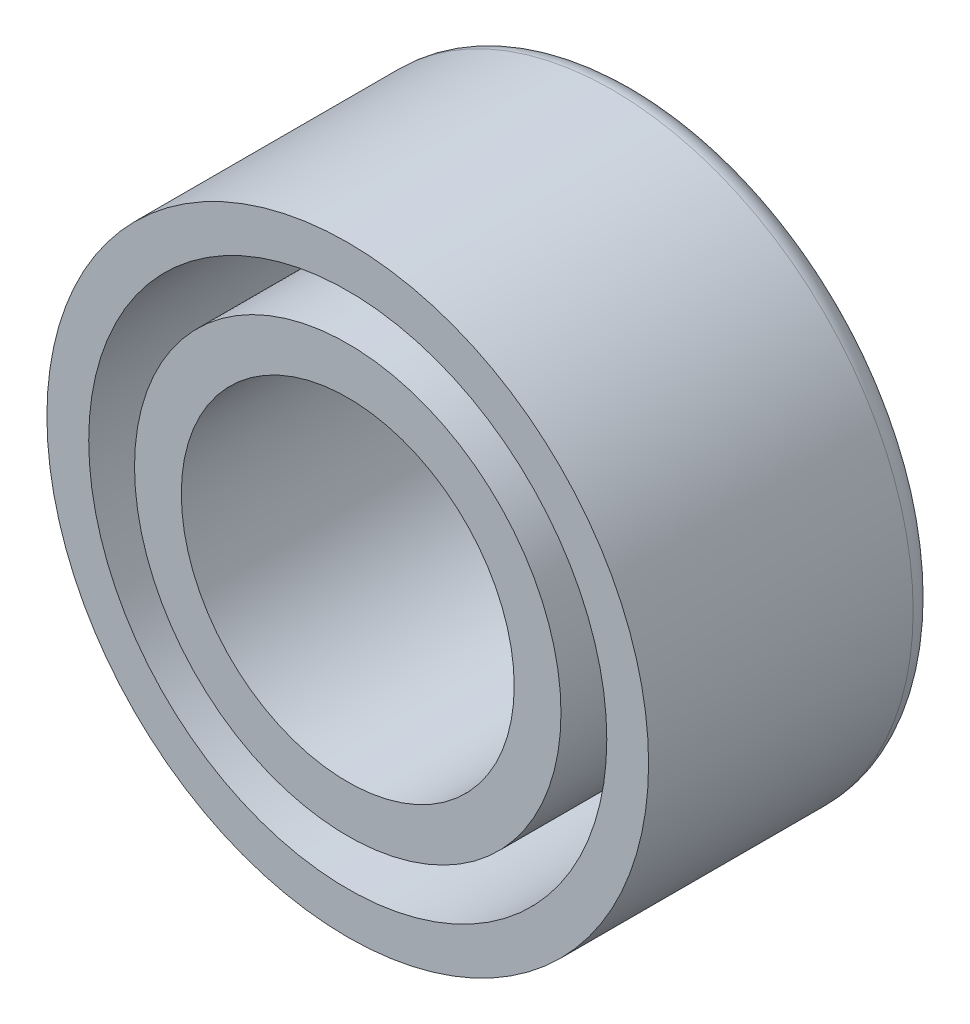
ISO-10303-21;
HEADER;
FILE_DESCRIPTION(('STEP AP214'),'2;1');
FILE_NAME('part.step','',(''),(''),'','','');
FILE_SCHEMA(('AUTOMOTIVE_DESIGN { 1 0 10303 214 1 1 1 1 }'));
ENDSEC;
DATA;
#1=APPLICATION_CONTEXT('core data for automotive mechanical design processes');
#2=APPLICATION_PROTOCOL_DEFINITION('international standard','automotive_design',2000,#1);
#3=PRODUCT_CONTEXT('',#1,'mechanical');
#4=PRODUCT('Part','Part','',(#3));
#5=PRODUCT_RELATED_PRODUCT_CATEGORY('part','',(#4));
#6=PRODUCT_DEFINITION_FORMATION('','',#4);
#7=PRODUCT_DEFINITION_CONTEXT('part definition',#1,'design');
#8=PRODUCT_DEFINITION('design','',#6,#7);
#9=PRODUCT_DEFINITION_SHAPE('','',#8);
#10=(LENGTH_UNIT() NAMED_UNIT(*) SI_UNIT(.MILLI.,.METRE.));
#11=(NAMED_UNIT(*) PLANE_ANGLE_UNIT() SI_UNIT($,.RADIAN.));
#12=(NAMED_UNIT(*) SI_UNIT($,.STERADIAN.) SOLID_ANGLE_UNIT());
#13=UNCERTAINTY_MEASURE_WITH_UNIT(LENGTH_MEASURE(1.E-05),#10,'distance_accuracy_value','');
#14=(GEOMETRIC_REPRESENTATION_CONTEXT(3) GLOBAL_UNCERTAINTY_ASSIGNED_CONTEXT((#13)) GLOBAL_UNIT_ASSIGNED_CONTEXT((#10,
#11,#12)) REPRESENTATION_CONTEXT('',''));
#15=CARTESIAN_POINT('',(0.,0.,0.));
#16=DIRECTION('',(0.,0.,1.));
#17=DIRECTION('',(1.,0.,0.));
#18=AXIS2_PLACEMENT_3D('',#15,#16,#17);
#19=CARTESIAN_POINT('',(0.,0.,12.));
#20=DIRECTION('',(0.,0.,1.));
#21=DIRECTION('',(1.,0.,0.));
#22=AXIS2_PLACEMENT_3D('',#19,#20,#21);
#23=PLANE('',#22);
#24=CARTESIAN_POINT('',(0.,0.,12.));
#25=DIRECTION('',(0.,0.,1.));
#26=DIRECTION('',(1.,0.,0.));
#27=AXIS2_PLACEMENT_3D('',#24,#25,#26);
#28=CIRCLE('',#27,6.9215);
#29=CARTESIAN_POINT('',(6.9215,0.,12.));
#30=VERTEX_POINT('',#29);
#31=EDGE_CURVE('E54',#30,#30,#28,.T.);
#32=ORIENTED_EDGE('',*,*,#31,.F.);
#33=EDGE_LOOP('',(#32));
#34=FACE_BOUND('',#33,.T.);
#35=CARTESIAN_POINT('',(0.,0.,12.));
#36=DIRECTION('',(0.,0.,1.));
#37=DIRECTION('',(1.,0.,0.));
#38=AXIS2_PLACEMENT_3D('',#35,#36,#37);
#39=CIRCLE('',#38,8.8665);
#40=CARTESIAN_POINT('',(8.8665,0.,12.));
#41=VERTEX_POINT('',#40);
#42=EDGE_CURVE('E64',#41,#41,#39,.T.);
#43=ORIENTED_EDGE('',*,*,#42,.T.);
#44=EDGE_LOOP('',(#43));
#45=FACE_BOUND('',#44,.T.);
#46=ADVANCED_FACE('F31',(#34,#45),#23,.T.);
#47=CARTESIAN_POINT('',(0.,0.,12.));
#48=DIRECTION('',(0.,0.,1.));
#49=DIRECTION('',(1.,0.,0.));
#50=AXIS2_PLACEMENT_3D('',#47,#48,#49);
#51=CIRCLE('',#50,10.7715);
#52=CARTESIAN_POINT('',(10.7715,0.,12.));
#53=VERTEX_POINT('',#52);
#54=EDGE_CURVE('E58',#53,#53,#51,.T.);
#55=ORIENTED_EDGE('',*,*,#54,.F.);
#56=EDGE_LOOP('',(#55));
#57=FACE_BOUND('',#56,.T.);
#58=CARTESIAN_POINT('',(0.,0.,12.));
#59=DIRECTION('',(0.,0.,1.));
#60=DIRECTION('',(1.,0.,0.));
#61=AXIS2_PLACEMENT_3D('',#58,#59,#60);
#62=CIRCLE('',#61,12.5095);
#63=CARTESIAN_POINT('',(12.5095,0.,12.));
#64=VERTEX_POINT('',#63);
#65=EDGE_CURVE('E51',#64,#64,#62,.T.);
#66=ORIENTED_EDGE('',*,*,#65,.T.);
#67=EDGE_LOOP('',(#66));
#68=FACE_BOUND('',#67,.T.);
#69=ADVANCED_FACE('F85',(#57,#68),#23,.T.);
#70=CARTESIAN_POINT('',(0.,0.,0.));
#71=DIRECTION('',(0.,0.,1.));
#72=DIRECTION('',(1.,0.,0.));
#73=AXIS2_PLACEMENT_3D('',#70,#71,#72);
#74=PLANE('',#73);
#75=CARTESIAN_POINT('',(0.,0.,0.));
#76=DIRECTION('',(0.,0.,1.));
#77=DIRECTION('',(1.,0.,0.));
#78=AXIS2_PLACEMENT_3D('',#75,#76,#77);
#79=CIRCLE('',#78,7.9215);
#80=CARTESIAN_POINT('',(7.9215,0.,0.));
#81=VERTEX_POINT('',#80);
#82=EDGE_CURVE('E42',#81,#81,#79,.T.);
#83=ORIENTED_EDGE('',*,*,#82,.T.);
#84=EDGE_LOOP('',(#83));
#85=FACE_BOUND('',#84,.T.);
#86=CARTESIAN_POINT('',(0.,0.,0.));
#87=DIRECTION('',(0.,0.,1.));
#88=DIRECTION('',(1.,0.,0.));
#89=AXIS2_PLACEMENT_3D('',#86,#87,#88);
#90=CIRCLE('',#89,11.5095);
#91=CARTESIAN_POINT('',(11.5095,0.,0.));
#92=VERTEX_POINT('',#91);
#93=EDGE_CURVE('E46',#92,#92,#90,.F.);
#94=ORIENTED_EDGE('',*,*,#93,.T.);
#95=EDGE_LOOP('',(#94));
#96=FACE_BOUND('',#95,.T.);
#97=ADVANCED_FACE('F88',(#85,#96),#74,.F.);
#98=CARTESIAN_POINT('',(0.,0.,12.));
#99=DIRECTION('',(0.,0.,-1.));
#100=DIRECTION('',(-1.,0.,0.));
#101=AXIS2_PLACEMENT_3D('',#98,#99,#100);
#102=CYLINDRICAL_SURFACE('',#101,12.5095);
#103=CARTESIAN_POINT('',(0.,0.,1.));
#104=DIRECTION('',(0.,0.,1.));
#105=DIRECTION('',(1.,0.,0.));
#106=AXIS2_PLACEMENT_3D('',#103,#104,#105);
#107=CIRCLE('',#106,12.5095);
#108=CARTESIAN_POINT('',(12.5095,0.,1.));
#109=VERTEX_POINT('',#108);
#110=EDGE_CURVE('E10',#109,#109,#107,.T.);
#111=ORIENTED_EDGE('',*,*,#110,.T.);
#112=EDGE_LOOP('',(#111));
#113=FACE_BOUND('',#112,.T.);
#114=ORIENTED_EDGE('',*,*,#65,.F.);
#115=EDGE_LOOP('',(#114));
#116=FACE_BOUND('',#115,.T.);
#117=ADVANCED_FACE('F92',(#113,#116),#102,.T.);
#118=CARTESIAN_POINT('',(0.,0.,12.));
#119=DIRECTION('',(0.,0.,-1.));
#120=DIRECTION('',(-1.,0.,0.));
#121=AXIS2_PLACEMENT_3D('',#118,#119,#120);
#122=CYLINDRICAL_SURFACE('',#121,6.9215);
#123=CARTESIAN_POINT('',(0.,0.,1.));
#124=DIRECTION('',(0.,0.,1.));
#125=DIRECTION('',(1.,0.,0.));
#126=AXIS2_PLACEMENT_3D('',#123,#124,#125);
#127=CIRCLE('',#126,6.9215);
#128=CARTESIAN_POINT('',(6.9215,0.,1.));
#129=VERTEX_POINT('',#128);
#130=EDGE_CURVE('E38',#129,#129,#127,.F.);
#131=ORIENTED_EDGE('',*,*,#130,.T.);
#132=EDGE_LOOP('',(#131));
#133=FACE_BOUND('',#132,.T.);
#134=ORIENTED_EDGE('',*,*,#31,.T.);
#135=EDGE_LOOP('',(#134));
#136=FACE_BOUND('',#135,.T.);
#137=ADVANCED_FACE('F94',(#133,#136),#122,.F.);
#138=CARTESIAN_POINT('',(0.,0.,1.));
#139=DIRECTION('',(0.,0.,1.));
#140=DIRECTION('',(1.,0.,0.));
#141=AXIS2_PLACEMENT_3D('',#138,#139,#140);
#142=TOROIDAL_SURFACE('',#141,7.9215,1.);
#143=ORIENTED_EDGE('',*,*,#130,.F.);
#144=EDGE_LOOP('',(#143));
#145=FACE_BOUND('',#144,.T.);
#146=ORIENTED_EDGE('',*,*,#82,.F.);
#147=EDGE_LOOP('',(#146));
#148=FACE_BOUND('',#147,.T.);
#149=ADVANCED_FACE('F100',(#145,#148),#142,.T.);
#150=CARTESIAN_POINT('',(0.,0.,1.));
#151=DIRECTION('',(0.,0.,1.));
#152=DIRECTION('',(1.,0.,0.));
#153=AXIS2_PLACEMENT_3D('',#150,#151,#152);
#154=TOROIDAL_SURFACE('',#153,11.5095,1.);
#155=ORIENTED_EDGE('',*,*,#93,.F.);
#156=EDGE_LOOP('',(#155));
#157=FACE_BOUND('',#156,.T.);
#158=ORIENTED_EDGE('',*,*,#110,.F.);
#159=EDGE_LOOP('',(#158));
#160=FACE_BOUND('',#159,.T.);
#161=ADVANCED_FACE('F33',(#157,#160),#154,.T.);
#162=CARTESIAN_POINT('',(0.,0.,3.));
#163=DIRECTION('',(0.,0.,1.));
#164=DIRECTION('',(1.,0.,0.));
#165=AXIS2_PLACEMENT_3D('',#162,#163,#164);
#166=CYLINDRICAL_SURFACE('',#165,10.7715);
#167=CARTESIAN_POINT('',(0.,0.,3.));
#168=DIRECTION('',(0.,0.,1.));
#169=DIRECTION('',(1.,0.,0.));
#170=AXIS2_PLACEMENT_3D('',#167,#168,#169);
#171=CIRCLE('',#170,10.7715);
#172=CARTESIAN_POINT('',(10.7715,0.,3.));
#173=VERTEX_POINT('',#172);
#174=EDGE_CURVE('E57',#173,#173,#171,.T.);
#175=ORIENTED_EDGE('',*,*,#174,.F.);
#176=EDGE_LOOP('',(#175));
#177=FACE_BOUND('',#176,.T.);
#178=ORIENTED_EDGE('',*,*,#54,.T.);
#179=EDGE_LOOP('',(#178));
#180=FACE_BOUND('',#179,.T.);
#181=ADVANCED_FACE('F76',(#177,#180),#166,.F.);
#182=CARTESIAN_POINT('',(0.,0.,3.));
#183=DIRECTION('',(0.,0.,1.));
#184=DIRECTION('',(1.,0.,0.));
#185=AXIS2_PLACEMENT_3D('',#182,#183,#184);
#186=PLANE('',#185);
#187=CARTESIAN_POINT('',(0.,0.,3.));
#188=DIRECTION('',(0.,0.,1.));
#189=DIRECTION('',(1.,0.,0.));
#190=AXIS2_PLACEMENT_3D('',#187,#188,#189);
#191=CIRCLE('',#190,8.8665);
#192=CARTESIAN_POINT('',(8.8665,0.,3.));
#193=VERTEX_POINT('',#192);
#194=EDGE_CURVE('E61',#193,#193,#191,.T.);
#195=ORIENTED_EDGE('',*,*,#194,.F.);
#196=EDGE_LOOP('',(#195));
#197=FACE_BOUND('',#196,.T.);
#198=ORIENTED_EDGE('',*,*,#174,.T.);
#199=EDGE_LOOP('',(#198));
#200=FACE_BOUND('',#199,.T.);
#201=ADVANCED_FACE('F73',(#197,#200),#186,.T.);
#202=CARTESIAN_POINT('',(0.,0.,3.));
#203=DIRECTION('',(0.,0.,1.));
#204=DIRECTION('',(1.,0.,0.));
#205=AXIS2_PLACEMENT_3D('',#202,#203,#204);
#206=CYLINDRICAL_SURFACE('',#205,8.8665);
#207=ORIENTED_EDGE('',*,*,#194,.T.);
#208=EDGE_LOOP('',(#207));
#209=FACE_BOUND('',#208,.T.);
#210=ORIENTED_EDGE('',*,*,#42,.F.);
#211=EDGE_LOOP('',(#210));
#212=FACE_BOUND('',#211,.T.);
#213=ADVANCED_FACE('F70',(#209,#212),#206,.T.);
#214=CLOSED_SHELL('',(#46,#69,#97,#117,#137,#149,#161,#181,#201,#213));
#215=MANIFOLD_SOLID_BREP('B2',#214);
#216=ADVANCED_BREP_SHAPE_REPRESENTATION('',(#18,#215),#14);
#217=SHAPE_DEFINITION_REPRESENTATION(#9,#216);
ENDSEC;
END-ISO-10303-21;
